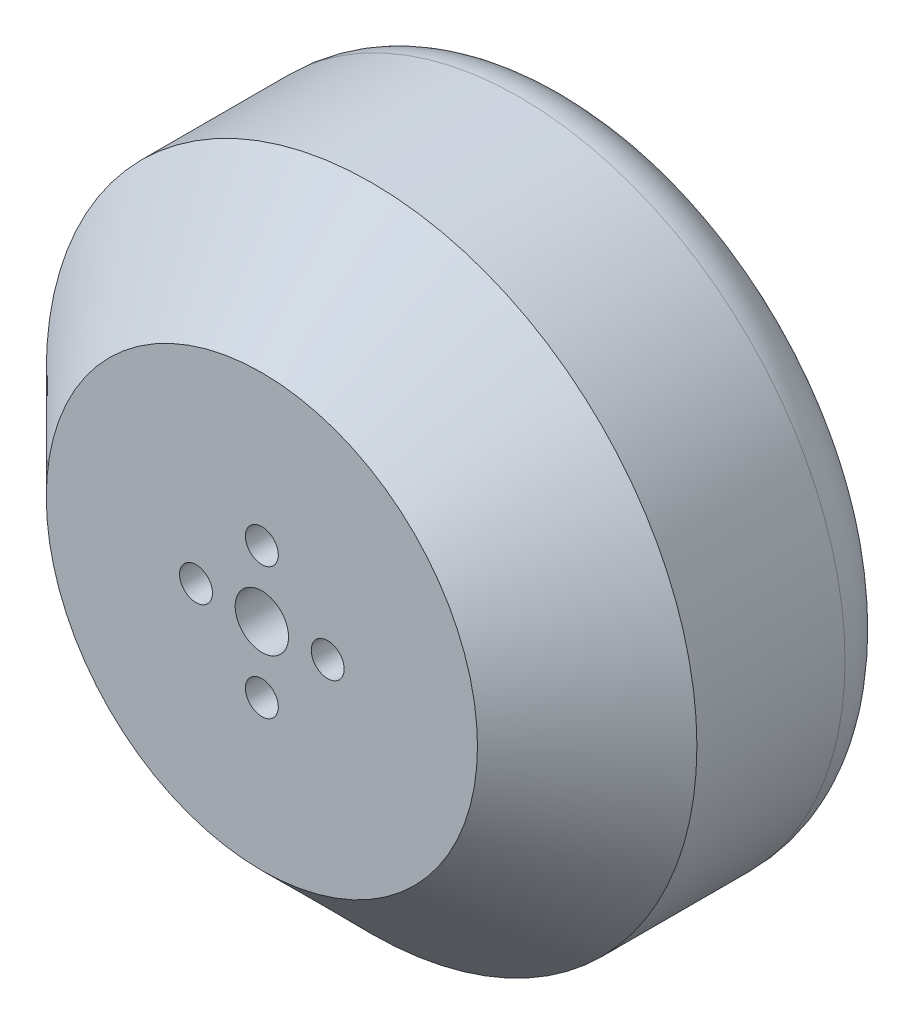
ISO-10303-21;
HEADER;
FILE_DESCRIPTION(('STEP AP214'),'2;1');
FILE_NAME('part.step','',(''),(''),'','','');
FILE_SCHEMA(('AUTOMOTIVE_DESIGN { 1 0 10303 214 1 1 1 1 }'));
ENDSEC;
DATA;
#1=APPLICATION_CONTEXT('core data for automotive mechanical design processes');
#2=APPLICATION_PROTOCOL_DEFINITION('international standard','automotive_design',2000,#1);
#3=PRODUCT_CONTEXT('',#1,'mechanical');
#4=PRODUCT('Part','Part','',(#3));
#5=PRODUCT_RELATED_PRODUCT_CATEGORY('part','',(#4));
#6=PRODUCT_DEFINITION_FORMATION('','',#4);
#7=PRODUCT_DEFINITION_CONTEXT('part definition',#1,'design');
#8=PRODUCT_DEFINITION('design','',#6,#7);
#9=PRODUCT_DEFINITION_SHAPE('','',#8);
#10=(LENGTH_UNIT() NAMED_UNIT(*) SI_UNIT(.MILLI.,.METRE.));
#11=(NAMED_UNIT(*) PLANE_ANGLE_UNIT() SI_UNIT($,.RADIAN.));
#12=(NAMED_UNIT(*) SI_UNIT($,.STERADIAN.) SOLID_ANGLE_UNIT());
#13=UNCERTAINTY_MEASURE_WITH_UNIT(LENGTH_MEASURE(1.E-05),#10,'distance_accuracy_value','');
#14=(GEOMETRIC_REPRESENTATION_CONTEXT(3) GLOBAL_UNCERTAINTY_ASSIGNED_CONTEXT((#13)) GLOBAL_UNIT_ASSIGNED_CONTEXT((#10,
#11,#12)) REPRESENTATION_CONTEXT('',''));
#15=CARTESIAN_POINT('',(0.,0.,0.));
#16=DIRECTION('',(0.,0.,1.));
#17=DIRECTION('',(1.,0.,0.));
#18=AXIS2_PLACEMENT_3D('',#15,#16,#17);
#19=CARTESIAN_POINT('',(-37.2474909957433,0.,28.5));
#20=DIRECTION('',(0.,0.,-1.));
#21=DIRECTION('',(-1.,0.,0.));
#22=AXIS2_PLACEMENT_3D('',#19,#20,#21);
#23=CYLINDRICAL_SURFACE('',#22,29.65);
#24=CARTESIAN_POINT('',(-37.2474909957433,0.,5.));
#25=DIRECTION('',(0.,0.,1.));
#26=DIRECTION('',(1.,0.,0.));
#27=AXIS2_PLACEMENT_3D('',#24,#25,#26);
#28=CIRCLE('',#27,29.65);
#29=CARTESIAN_POINT('',(-7.59749099574327,0.,5.));
#30=VERTEX_POINT('',#29);
#31=EDGE_CURVE('E40',#30,#30,#28,.T.);
#32=ORIENTED_EDGE('',*,*,#31,.T.);
#33=EDGE_LOOP('',(#32));
#34=FACE_BOUND('',#33,.T.);
#35=CARTESIAN_POINT('',(-37.2474909957433,0.,18.5));
#36=DIRECTION('',(0.,0.,1.));
#37=DIRECTION('',(1.,0.,0.));
#38=AXIS2_PLACEMENT_3D('',#35,#36,#37);
#39=CIRCLE('',#38,29.65);
#40=CARTESIAN_POINT('',(-7.59749099574327,0.,18.5));
#41=VERTEX_POINT('',#40);
#42=EDGE_CURVE('E44',#41,#41,#39,.F.);
#43=ORIENTED_EDGE('',*,*,#42,.T.);
#44=EDGE_LOOP('',(#43));
#45=FACE_BOUND('',#44,.T.);
#46=ADVANCED_FACE('F33',(#34,#45),#23,.T.);
#47=CARTESIAN_POINT('',(-37.2474909957433,0.,28.5));
#48=DIRECTION('',(0.,0.,1.));
#49=DIRECTION('',(1.,0.,0.));
#50=AXIS2_PLACEMENT_3D('',#47,#48,#49);
#51=PLANE('',#50);
#52=CARTESIAN_POINT('',(-37.2474909957433,5.99999999999999,28.5));
#53=DIRECTION('',(0.,0.,1.));
#54=DIRECTION('',(1.,0.,0.));
#55=AXIS2_PLACEMENT_3D('',#52,#53,#54);
#56=CIRCLE('',#55,1.5);
#57=CARTESIAN_POINT('',(-35.7474909957433,5.99999999999999,28.5));
#58=VERTEX_POINT('',#57);
#59=EDGE_CURVE('E67',#58,#58,#56,.T.);
#60=ORIENTED_EDGE('',*,*,#59,.F.);
#61=EDGE_LOOP('',(#60));
#62=FACE_BOUND('',#61,.T.);
#63=CARTESIAN_POINT('',(-37.2474909957433,0.,28.5));
#64=DIRECTION('',(0.,0.,1.));
#65=DIRECTION('',(1.,0.,0.));
#66=AXIS2_PLACEMENT_3D('',#63,#64,#65);
#67=CIRCLE('',#66,2.42972026230687);
#68=CARTESIAN_POINT('',(-34.8177707334364,0.,28.5));
#69=VERTEX_POINT('',#68);
#70=EDGE_CURVE('E68',#69,#69,#67,.T.);
#71=ORIENTED_EDGE('',*,*,#70,.F.);
#72=EDGE_LOOP('',(#71));
#73=FACE_BOUND('',#72,.T.);
#74=CARTESIAN_POINT('',(-31.2474909957433,0.,28.5));
#75=DIRECTION('',(0.,0.,1.));
#76=DIRECTION('',(1.,0.,0.));
#77=AXIS2_PLACEMENT_3D('',#74,#75,#76);
#78=CIRCLE('',#77,1.5);
#79=CARTESIAN_POINT('',(-29.7474909957433,0.,28.5));
#80=VERTEX_POINT('',#79);
#81=EDGE_CURVE('E75',#80,#80,#78,.T.);
#82=ORIENTED_EDGE('',*,*,#81,.F.);
#83=EDGE_LOOP('',(#82));
#84=FACE_BOUND('',#83,.T.);
#85=CARTESIAN_POINT('',(-37.2474909957433,-5.99999999999999,28.5));
#86=DIRECTION('',(0.,0.,1.));
#87=DIRECTION('',(1.,0.,0.));
#88=AXIS2_PLACEMENT_3D('',#85,#86,#87);
#89=CIRCLE('',#88,1.5);
#90=CARTESIAN_POINT('',(-35.7474909957433,-5.99999999999999,28.5));
#91=VERTEX_POINT('',#90);
#92=EDGE_CURVE('E54',#91,#91,#89,.T.);
#93=ORIENTED_EDGE('',*,*,#92,.F.);
#94=EDGE_LOOP('',(#93));
#95=FACE_BOUND('',#94,.T.);
#96=CARTESIAN_POINT('',(-43.2474909957433,0.,28.5));
#97=DIRECTION('',(0.,0.,1.));
#98=DIRECTION('',(1.,0.,0.));
#99=AXIS2_PLACEMENT_3D('',#96,#97,#98);
#100=CIRCLE('',#99,1.5);
#101=CARTESIAN_POINT('',(-41.7474909957433,0.,28.5));
#102=VERTEX_POINT('',#101);
#103=EDGE_CURVE('E61',#102,#102,#100,.T.);
#104=ORIENTED_EDGE('',*,*,#103,.F.);
#105=EDGE_LOOP('',(#104));
#106=FACE_BOUND('',#105,.T.);
#107=CARTESIAN_POINT('',(-37.2474909957433,0.,28.5));
#108=DIRECTION('',(0.,0.,1.));
#109=DIRECTION('',(1.,0.,0.));
#110=AXIS2_PLACEMENT_3D('',#107,#108,#109);
#111=CIRCLE('',#110,19.6500000000001);
#112=CARTESIAN_POINT('',(-17.5974909957432,0.,28.5));
#113=VERTEX_POINT('',#112);
#114=EDGE_CURVE('E48',#113,#113,#111,.T.);
#115=ORIENTED_EDGE('',*,*,#114,.T.);
#116=EDGE_LOOP('',(#115));
#117=FACE_BOUND('',#116,.T.);
#118=ADVANCED_FACE('F121',(#62,#73,#84,#95,#106,#117),#51,.T.);
#119=CARTESIAN_POINT('',(-37.2474909957433,0.,0.));
#120=DIRECTION('',(0.,0.,1.));
#121=DIRECTION('',(1.,0.,0.));
#122=AXIS2_PLACEMENT_3D('',#119,#120,#121);
#123=PLANE('',#122);
#124=CARTESIAN_POINT('',(-37.2474909957433,12.5,0.));
#125=DIRECTION('',(0.,0.,-1.));
#126=DIRECTION('',(-1.,0.,0.));
#127=AXIS2_PLACEMENT_3D('',#124,#125,#126);
#128=CIRCLE('',#127,1.5);
#129=CARTESIAN_POINT('',(-38.7474909957433,12.5,0.));
#130=VERTEX_POINT('',#129);
#131=EDGE_CURVE('E102',#130,#130,#128,.T.);
#132=ORIENTED_EDGE('',*,*,#131,.F.);
#133=EDGE_LOOP('',(#132));
#134=FACE_BOUND('',#133,.T.);
#135=CARTESIAN_POINT('',(-49.7474909957433,0.,0.));
#136=DIRECTION('',(0.,0.,-1.));
#137=DIRECTION('',(-1.,0.,0.));
#138=AXIS2_PLACEMENT_3D('',#135,#136,#137);
#139=CIRCLE('',#138,1.5);
#140=CARTESIAN_POINT('',(-51.2474909957433,0.,0.));
#141=VERTEX_POINT('',#140);
#142=EDGE_CURVE('E96',#141,#141,#139,.T.);
#143=ORIENTED_EDGE('',*,*,#142,.F.);
#144=EDGE_LOOP('',(#143));
#145=FACE_BOUND('',#144,.T.);
#146=CARTESIAN_POINT('',(-24.7613740271932,0.588967781535473,0.));
#147=DIRECTION('',(0.,0.,-1.));
#148=DIRECTION('',(-1.,0.,0.));
#149=AXIS2_PLACEMENT_3D('',#146,#147,#148);
#150=CIRCLE('',#149,1.5);
#151=CARTESIAN_POINT('',(-26.2613740271932,0.588967781535473,0.));
#152=VERTEX_POINT('',#151);
#153=EDGE_CURVE('E90',#152,#152,#150,.T.);
#154=ORIENTED_EDGE('',*,*,#153,.F.);
#155=EDGE_LOOP('',(#154));
#156=FACE_BOUND('',#155,.T.);
#157=CARTESIAN_POINT('',(-37.2474909957433,-12.5,0.));
#158=DIRECTION('',(0.,0.,-1.));
#159=DIRECTION('',(-1.,0.,0.));
#160=AXIS2_PLACEMENT_3D('',#157,#158,#159);
#161=CIRCLE('',#160,1.5);
#162=CARTESIAN_POINT('',(-38.7474909957433,-12.5,0.));
#163=VERTEX_POINT('',#162);
#164=EDGE_CURVE('E84',#163,#163,#161,.T.);
#165=ORIENTED_EDGE('',*,*,#164,.F.);
#166=EDGE_LOOP('',(#165));
#167=FACE_BOUND('',#166,.T.);
#168=CARTESIAN_POINT('',(-37.2474909957433,0.,0.));
#169=DIRECTION('',(0.,0.,1.));
#170=DIRECTION('',(1.,0.,0.));
#171=AXIS2_PLACEMENT_3D('',#168,#169,#170);
#172=CIRCLE('',#171,24.65);
#173=CARTESIAN_POINT('',(-12.5974909957433,0.,0.));
#174=VERTEX_POINT('',#173);
#175=EDGE_CURVE('E10',#174,#174,#172,.F.);
#176=ORIENTED_EDGE('',*,*,#175,.T.);
#177=EDGE_LOOP('',(#176));
#178=FACE_BOUND('',#177,.T.);
#179=ADVANCED_FACE('F117',(#134,#145,#156,#167,#178),#123,.F.);
#180=CARTESIAN_POINT('',(-37.2474909957433,0.,28.5));
#181=DIRECTION('',(0.,0.,-1.));
#182=DIRECTION('',(-1.,0.,0.));
#183=AXIS2_PLACEMENT_3D('',#180,#181,#182);
#184=CONICAL_SURFACE('',#183,19.6500000000001,0.785398163397446);
#185=ORIENTED_EDGE('',*,*,#42,.F.);
#186=EDGE_LOOP('',(#185));
#187=FACE_BOUND('',#186,.T.);
#188=ORIENTED_EDGE('',*,*,#114,.F.);
#189=EDGE_LOOP('',(#188));
#190=FACE_BOUND('',#189,.T.);
#191=ADVANCED_FACE('F120',(#187,#190),#184,.T.);
#192=CARTESIAN_POINT('',(-37.2474909957433,0.,5.));
#193=DIRECTION('',(0.,0.,1.));
#194=DIRECTION('',(1.,0.,0.));
#195=AXIS2_PLACEMENT_3D('',#192,#193,#194);
#196=TOROIDAL_SURFACE('',#195,24.65,5.);
#197=ORIENTED_EDGE('',*,*,#175,.F.);
#198=EDGE_LOOP('',(#197));
#199=FACE_BOUND('',#198,.T.);
#200=ORIENTED_EDGE('',*,*,#31,.F.);
#201=EDGE_LOOP('',(#200));
#202=FACE_BOUND('',#201,.T.);
#203=ADVANCED_FACE('F35',(#199,#202),#196,.T.);
#204=CARTESIAN_POINT('',(-43.2474909957433,0.,19.));
#205=DIRECTION('',(0.,0.,1.));
#206=DIRECTION('',(1.,0.,0.));
#207=AXIS2_PLACEMENT_3D('',#204,#205,#206);
#208=CYLINDRICAL_SURFACE('',#207,1.5);
#209=CARTESIAN_POINT('',(-43.2474909957433,0.,19.));
#210=DIRECTION('',(0.,0.,1.));
#211=DIRECTION('',(1.,0.,0.));
#212=AXIS2_PLACEMENT_3D('',#209,#210,#211);
#213=CIRCLE('',#212,1.5);
#214=CARTESIAN_POINT('',(-41.7474909957433,0.,19.));
#215=VERTEX_POINT('',#214);
#216=EDGE_CURVE('E64',#215,#215,#213,.T.);
#217=ORIENTED_EDGE('',*,*,#216,.F.);
#218=EDGE_LOOP('',(#217));
#219=FACE_BOUND('',#218,.T.);
#220=ORIENTED_EDGE('',*,*,#103,.T.);
#221=EDGE_LOOP('',(#220));
#222=FACE_BOUND('',#221,.T.);
#223=ADVANCED_FACE('F159',(#219,#222),#208,.F.);
#224=CARTESIAN_POINT('',(-43.2474909957433,0.,19.));
#225=DIRECTION('',(0.,0.,1.));
#226=DIRECTION('',(1.,0.,0.));
#227=AXIS2_PLACEMENT_3D('',#224,#225,#226);
#228=PLANE('',#227);
#229=ORIENTED_EDGE('',*,*,#216,.T.);
#230=EDGE_LOOP('',(#229));
#231=FACE_BOUND('',#230,.T.);
#232=ADVANCED_FACE('F168',(#231),#228,.T.);
#233=CARTESIAN_POINT('',(-37.2474909957433,-5.99999999999999,19.));
#234=DIRECTION('',(0.,0.,1.));
#235=DIRECTION('',(1.,0.,0.));
#236=AXIS2_PLACEMENT_3D('',#233,#234,#235);
#237=CYLINDRICAL_SURFACE('',#236,1.5);
#238=CARTESIAN_POINT('',(-37.2474909957433,-5.99999999999999,19.));
#239=DIRECTION('',(0.,0.,1.));
#240=DIRECTION('',(1.,0.,0.));
#241=AXIS2_PLACEMENT_3D('',#238,#239,#240);
#242=CIRCLE('',#241,1.5);
#243=CARTESIAN_POINT('',(-35.7474909957433,-5.99999999999999,19.));
#244=VERTEX_POINT('',#243);
#245=EDGE_CURVE('E57',#244,#244,#242,.T.);
#246=ORIENTED_EDGE('',*,*,#245,.F.);
#247=EDGE_LOOP('',(#246));
#248=FACE_BOUND('',#247,.T.);
#249=ORIENTED_EDGE('',*,*,#92,.T.);
#250=EDGE_LOOP('',(#249));
#251=FACE_BOUND('',#250,.T.);
#252=ADVANCED_FACE('F175',(#248,#251),#237,.F.);
#253=CARTESIAN_POINT('',(-37.2474909957433,-5.99999999999999,19.));
#254=DIRECTION('',(0.,0.,1.));
#255=DIRECTION('',(1.,0.,0.));
#256=AXIS2_PLACEMENT_3D('',#253,#254,#255);
#257=PLANE('',#256);
#258=ORIENTED_EDGE('',*,*,#245,.T.);
#259=EDGE_LOOP('',(#258));
#260=FACE_BOUND('',#259,.T.);
#261=ADVANCED_FACE('F182',(#260),#257,.T.);
#262=CARTESIAN_POINT('',(-31.2474909957433,0.,19.));
#263=DIRECTION('',(0.,0.,1.));
#264=DIRECTION('',(1.,0.,0.));
#265=AXIS2_PLACEMENT_3D('',#262,#263,#264);
#266=CYLINDRICAL_SURFACE('',#265,1.5);
#267=CARTESIAN_POINT('',(-31.2474909957433,0.,19.));
#268=DIRECTION('',(0.,0.,1.));
#269=DIRECTION('',(1.,0.,0.));
#270=AXIS2_PLACEMENT_3D('',#267,#268,#269);
#271=CIRCLE('',#270,1.5);
#272=CARTESIAN_POINT('',(-29.7474909957433,0.,19.));
#273=VERTEX_POINT('',#272);
#274=EDGE_CURVE('E58',#273,#273,#271,.T.);
#275=ORIENTED_EDGE('',*,*,#274,.F.);
#276=EDGE_LOOP('',(#275));
#277=FACE_BOUND('',#276,.T.);
#278=ORIENTED_EDGE('',*,*,#81,.T.);
#279=EDGE_LOOP('',(#278));
#280=FACE_BOUND('',#279,.T.);
#281=ADVANCED_FACE('F185',(#277,#280),#266,.F.);
#282=CARTESIAN_POINT('',(-31.2474909957433,0.,19.));
#283=DIRECTION('',(0.,0.,1.));
#284=DIRECTION('',(1.,0.,0.));
#285=AXIS2_PLACEMENT_3D('',#282,#283,#284);
#286=PLANE('',#285);
#287=ORIENTED_EDGE('',*,*,#274,.T.);
#288=EDGE_LOOP('',(#287));
#289=FACE_BOUND('',#288,.T.);
#290=ADVANCED_FACE('F209',(#289),#286,.T.);
#291=CARTESIAN_POINT('',(-37.2474909957433,0.,19.));
#292=DIRECTION('',(0.,0.,1.));
#293=DIRECTION('',(1.,0.,0.));
#294=AXIS2_PLACEMENT_3D('',#291,#292,#293);
#295=CYLINDRICAL_SURFACE('',#294,2.42972026230687);
#296=CARTESIAN_POINT('',(-37.2474909957433,0.,19.));
#297=DIRECTION('',(0.,0.,1.));
#298=DIRECTION('',(1.,0.,0.));
#299=AXIS2_PLACEMENT_3D('',#296,#297,#298);
#300=CIRCLE('',#299,2.42972026230687);
#301=CARTESIAN_POINT('',(-34.8177707334364,0.,19.));
#302=VERTEX_POINT('',#301);
#303=EDGE_CURVE('E71',#302,#302,#300,.T.);
#304=ORIENTED_EDGE('',*,*,#303,.F.);
#305=EDGE_LOOP('',(#304));
#306=FACE_BOUND('',#305,.T.);
#307=ORIENTED_EDGE('',*,*,#70,.T.);
#308=EDGE_LOOP('',(#307));
#309=FACE_BOUND('',#308,.T.);
#310=ADVANCED_FACE('F217',(#306,#309),#295,.F.);
#311=CARTESIAN_POINT('',(-37.2474909957433,0.,19.));
#312=DIRECTION('',(0.,0.,1.));
#313=DIRECTION('',(1.,0.,0.));
#314=AXIS2_PLACEMENT_3D('',#311,#312,#313);
#315=PLANE('',#314);
#316=ORIENTED_EDGE('',*,*,#303,.T.);
#317=EDGE_LOOP('',(#316));
#318=FACE_BOUND('',#317,.T.);
#319=ADVANCED_FACE('F225',(#318),#315,.T.);
#320=CARTESIAN_POINT('',(-37.2474909957433,5.99999999999999,19.));
#321=DIRECTION('',(0.,0.,1.));
#322=DIRECTION('',(1.,0.,0.));
#323=AXIS2_PLACEMENT_3D('',#320,#321,#322);
#324=CYLINDRICAL_SURFACE('',#323,1.5);
#325=CARTESIAN_POINT('',(-37.2474909957433,5.99999999999999,19.));
#326=DIRECTION('',(0.,0.,1.));
#327=DIRECTION('',(1.,0.,0.));
#328=AXIS2_PLACEMENT_3D('',#325,#326,#327);
#329=CIRCLE('',#328,1.5);
#330=CARTESIAN_POINT('',(-35.7474909957433,5.99999999999999,19.));
#331=VERTEX_POINT('',#330);
#332=EDGE_CURVE('E53',#331,#331,#329,.T.);
#333=ORIENTED_EDGE('',*,*,#332,.F.);
#334=EDGE_LOOP('',(#333));
#335=FACE_BOUND('',#334,.T.);
#336=ORIENTED_EDGE('',*,*,#59,.T.);
#337=EDGE_LOOP('',(#336));
#338=FACE_BOUND('',#337,.T.);
#339=ADVANCED_FACE('F142',(#335,#338),#324,.F.);
#340=CARTESIAN_POINT('',(-37.2474909957433,5.99999999999999,19.));
#341=DIRECTION('',(0.,0.,1.));
#342=DIRECTION('',(1.,0.,0.));
#343=AXIS2_PLACEMENT_3D('',#340,#341,#342);
#344=PLANE('',#343);
#345=ORIENTED_EDGE('',*,*,#332,.T.);
#346=EDGE_LOOP('',(#345));
#347=FACE_BOUND('',#346,.T.);
#348=ADVANCED_FACE('F132',(#347),#344,.T.);
#349=CARTESIAN_POINT('',(-37.2474909957433,-12.5,9.49999999999999));
#350=DIRECTION('',(0.,0.,-1.));
#351=DIRECTION('',(-1.,0.,0.));
#352=AXIS2_PLACEMENT_3D('',#349,#350,#351);
#353=CYLINDRICAL_SURFACE('',#352,1.5);
#354=CARTESIAN_POINT('',(-37.2474909957433,-12.5,9.49999999999999));
#355=DIRECTION('',(0.,0.,-1.));
#356=DIRECTION('',(-1.,0.,0.));
#357=AXIS2_PLACEMENT_3D('',#354,#355,#356);
#358=CIRCLE('',#357,1.5);
#359=CARTESIAN_POINT('',(-38.7474909957433,-12.5,9.49999999999999));
#360=VERTEX_POINT('',#359);
#361=EDGE_CURVE('E87',#360,#360,#358,.T.);
#362=ORIENTED_EDGE('',*,*,#361,.F.);
#363=EDGE_LOOP('',(#362));
#364=FACE_BOUND('',#363,.T.);
#365=ORIENTED_EDGE('',*,*,#164,.T.);
#366=EDGE_LOOP('',(#365));
#367=FACE_BOUND('',#366,.T.);
#368=ADVANCED_FACE('F129',(#364,#367),#353,.F.);
#369=CARTESIAN_POINT('',(-37.2474909957433,-12.5,9.49999999999999));
#370=DIRECTION('',(0.,0.,-1.));
#371=DIRECTION('',(-1.,0.,0.));
#372=AXIS2_PLACEMENT_3D('',#369,#370,#371);
#373=PLANE('',#372);
#374=ORIENTED_EDGE('',*,*,#361,.T.);
#375=EDGE_LOOP('',(#374));
#376=FACE_BOUND('',#375,.T.);
#377=ADVANCED_FACE('F131',(#376),#373,.T.);
#378=CARTESIAN_POINT('',(-24.7613740271932,0.588967781535473,9.49999999999999));
#379=DIRECTION('',(0.,0.,-1.));
#380=DIRECTION('',(-1.,0.,0.));
#381=AXIS2_PLACEMENT_3D('',#378,#379,#380);
#382=CYLINDRICAL_SURFACE('',#381,1.5);
#383=CARTESIAN_POINT('',(-24.7613740271932,0.588967781535473,9.49999999999999));
#384=DIRECTION('',(0.,0.,-1.));
#385=DIRECTION('',(-1.,0.,0.));
#386=AXIS2_PLACEMENT_3D('',#383,#384,#385);
#387=CIRCLE('',#386,1.5);
#388=CARTESIAN_POINT('',(-26.2613740271932,0.588967781535473,9.49999999999999));
#389=VERTEX_POINT('',#388);
#390=EDGE_CURVE('E93',#389,#389,#387,.T.);
#391=ORIENTED_EDGE('',*,*,#390,.F.);
#392=EDGE_LOOP('',(#391));
#393=FACE_BOUND('',#392,.T.);
#394=ORIENTED_EDGE('',*,*,#153,.T.);
#395=EDGE_LOOP('',(#394));
#396=FACE_BOUND('',#395,.T.);
#397=ADVANCED_FACE('F139',(#393,#396),#382,.F.);
#398=CARTESIAN_POINT('',(-24.7613740271932,0.588967781535473,9.49999999999999));
#399=DIRECTION('',(0.,0.,-1.));
#400=DIRECTION('',(-1.,0.,0.));
#401=AXIS2_PLACEMENT_3D('',#398,#399,#400);
#402=PLANE('',#401);
#403=ORIENTED_EDGE('',*,*,#390,.T.);
#404=EDGE_LOOP('',(#403));
#405=FACE_BOUND('',#404,.T.);
#406=ADVANCED_FACE('F271',(#405),#402,.T.);
#407=CARTESIAN_POINT('',(-49.7474909957433,0.,9.49999999999999));
#408=DIRECTION('',(0.,0.,-1.));
#409=DIRECTION('',(-1.,0.,0.));
#410=AXIS2_PLACEMENT_3D('',#407,#408,#409);
#411=CYLINDRICAL_SURFACE('',#410,1.5);
#412=CARTESIAN_POINT('',(-49.7474909957433,0.,9.49999999999999));
#413=DIRECTION('',(0.,0.,-1.));
#414=DIRECTION('',(-1.,0.,0.));
#415=AXIS2_PLACEMENT_3D('',#412,#413,#414);
#416=CIRCLE('',#415,1.5);
#417=CARTESIAN_POINT('',(-51.2474909957433,0.,9.49999999999999));
#418=VERTEX_POINT('',#417);
#419=EDGE_CURVE('E99',#418,#418,#416,.T.);
#420=ORIENTED_EDGE('',*,*,#419,.F.);
#421=EDGE_LOOP('',(#420));
#422=FACE_BOUND('',#421,.T.);
#423=ORIENTED_EDGE('',*,*,#142,.T.);
#424=EDGE_LOOP('',(#423));
#425=FACE_BOUND('',#424,.T.);
#426=ADVANCED_FACE('F281',(#422,#425),#411,.F.);
#427=CARTESIAN_POINT('',(-49.7474909957433,0.,9.49999999999999));
#428=DIRECTION('',(0.,0.,-1.));
#429=DIRECTION('',(-1.,0.,0.));
#430=AXIS2_PLACEMENT_3D('',#427,#428,#429);
#431=PLANE('',#430);
#432=ORIENTED_EDGE('',*,*,#419,.T.);
#433=EDGE_LOOP('',(#432));
#434=FACE_BOUND('',#433,.T.);
#435=ADVANCED_FACE('F113',(#434),#431,.T.);
#436=CARTESIAN_POINT('',(-37.2474909957433,12.5,9.49999999999999));
#437=DIRECTION('',(0.,0.,-1.));
#438=DIRECTION('',(-1.,0.,0.));
#439=AXIS2_PLACEMENT_3D('',#436,#437,#438);
#440=CYLINDRICAL_SURFACE('',#439,1.5);
#441=CARTESIAN_POINT('',(-37.2474909957433,12.5,9.49999999999999));
#442=DIRECTION('',(0.,0.,-1.));
#443=DIRECTION('',(-1.,0.,0.));
#444=AXIS2_PLACEMENT_3D('',#441,#442,#443);
#445=CIRCLE('',#444,1.5);
#446=CARTESIAN_POINT('',(-38.7474909957433,12.5,9.49999999999999));
#447=VERTEX_POINT('',#446);
#448=EDGE_CURVE('E72',#447,#447,#445,.T.);
#449=ORIENTED_EDGE('',*,*,#448,.F.);
#450=EDGE_LOOP('',(#449));
#451=FACE_BOUND('',#450,.T.);
#452=ORIENTED_EDGE('',*,*,#131,.T.);
#453=EDGE_LOOP('',(#452));
#454=FACE_BOUND('',#453,.T.);
#455=ADVANCED_FACE('F110',(#451,#454),#440,.F.);
#456=CARTESIAN_POINT('',(-37.2474909957433,12.5,9.49999999999999));
#457=DIRECTION('',(0.,0.,-1.));
#458=DIRECTION('',(-1.,0.,0.));
#459=AXIS2_PLACEMENT_3D('',#456,#457,#458);
#460=PLANE('',#459);
#461=ORIENTED_EDGE('',*,*,#448,.T.);
#462=EDGE_LOOP('',(#461));
#463=FACE_BOUND('',#462,.T.);
#464=ADVANCED_FACE('F108',(#463),#460,.T.);
#465=CLOSED_SHELL('',(#46,#118,#179,#191,#203,#223,#232,#252,#261,#281,#290,#310,#319,#339,#348,
#368,#377,#397,#406,#426,#435,#455,#464));
#466=MANIFOLD_SOLID_BREP('B2',#465);
#467=ADVANCED_BREP_SHAPE_REPRESENTATION('',(#18,#466),#14);
#468=SHAPE_DEFINITION_REPRESENTATION(#9,#467);
ENDSEC;
END-ISO-10303-21;
